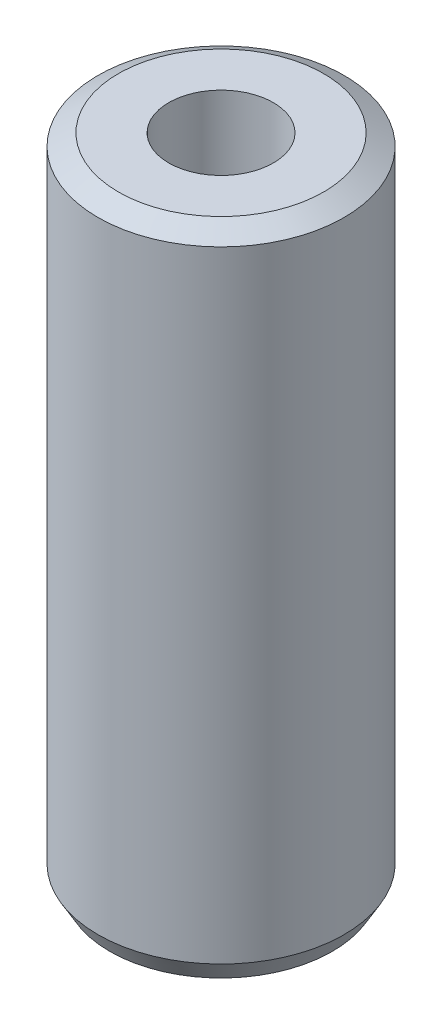
ISO-10303-21;
HEADER;
FILE_DESCRIPTION(('STEP AP214'),'2;1');
FILE_NAME('part.step','',(''),(''),'','','');
FILE_SCHEMA(('AUTOMOTIVE_DESIGN { 1 0 10303 214 1 1 1 1 }'));
ENDSEC;
DATA;
#1=APPLICATION_CONTEXT('core data for automotive mechanical design processes');
#2=APPLICATION_PROTOCOL_DEFINITION('international standard','automotive_design',2000,#1);
#3=PRODUCT_CONTEXT('',#1,'mechanical');
#4=PRODUCT('Part','Part','',(#3));
#5=PRODUCT_RELATED_PRODUCT_CATEGORY('part','',(#4));
#6=PRODUCT_DEFINITION_FORMATION('','',#4);
#7=PRODUCT_DEFINITION_CONTEXT('part definition',#1,'design');
#8=PRODUCT_DEFINITION('design','',#6,#7);
#9=PRODUCT_DEFINITION_SHAPE('','',#8);
#10=(LENGTH_UNIT() NAMED_UNIT(*) SI_UNIT(.MILLI.,.METRE.));
#11=(NAMED_UNIT(*) PLANE_ANGLE_UNIT() SI_UNIT($,.RADIAN.));
#12=(NAMED_UNIT(*) SI_UNIT($,.STERADIAN.) SOLID_ANGLE_UNIT());
#13=UNCERTAINTY_MEASURE_WITH_UNIT(LENGTH_MEASURE(1.E-05),#10,'distance_accuracy_value','');
#14=(GEOMETRIC_REPRESENTATION_CONTEXT(3) GLOBAL_UNCERTAINTY_ASSIGNED_CONTEXT((#13)) GLOBAL_UNIT_ASSIGNED_CONTEXT((#10,
#11,#12)) REPRESENTATION_CONTEXT('',''));
#15=CARTESIAN_POINT('',(0.,0.,0.));
#16=DIRECTION('',(0.,0.,1.));
#17=DIRECTION('',(1.,0.,0.));
#18=AXIS2_PLACEMENT_3D('',#15,#16,#17);
#19=CARTESIAN_POINT('',(0.,172.520171997669,0.));
#20=DIRECTION('',(0.,-1.,0.));
#21=DIRECTION('',(0.,0.,-1.));
#22=AXIS2_PLACEMENT_3D('',#19,#20,#21);
#23=CYLINDRICAL_SURFACE('',#22,32.5);
#24=CARTESIAN_POINT('',(0.,169.400193506494,0.));
#25=DIRECTION('',(0.,1.,0.));
#26=DIRECTION('',(0.,0.,1.));
#27=AXIS2_PLACEMENT_3D('',#24,#25,#26);
#28=CIRCLE('',#27,32.5);
#29=CARTESIAN_POINT('',(0.,169.400193506494,32.5));
#30=VERTEX_POINT('',#29);
#31=EDGE_CURVE('E50',#30,#30,#28,.F.);
#32=ORIENTED_EDGE('',*,*,#31,.T.);
#33=EDGE_LOOP('',(#32));
#34=FACE_BOUND('',#33,.T.);
#35=CARTESIAN_POINT('',(0.,5.40396126523684,0.));
#36=DIRECTION('',(0.,1.,0.));
#37=DIRECTION('',(0.,0.,1.));
#38=AXIS2_PLACEMENT_3D('',#35,#36,#37);
#39=CIRCLE('',#38,32.5);
#40=CARTESIAN_POINT('',(0.,5.40396126523684,32.5));
#41=VERTEX_POINT('',#40);
#42=EDGE_CURVE('E51',#41,#41,#39,.T.);
#43=ORIENTED_EDGE('',*,*,#42,.T.);
#44=EDGE_LOOP('',(#43));
#45=FACE_BOUND('',#44,.T.);
#46=ADVANCED_FACE('F39',(#34,#45),#23,.T.);
#47=CARTESIAN_POINT('',(0.,172.520171997669,0.));
#48=DIRECTION('',(0.,1.,0.));
#49=DIRECTION('',(0.,0.,1.));
#50=AXIS2_PLACEMENT_3D('',#47,#48,#49);
#51=PLANE('',#50);
#52=CARTESIAN_POINT('',(0.,172.520171997669,0.));
#53=DIRECTION('',(0.,1.,0.));
#54=DIRECTION('',(0.,0.,1.));
#55=AXIS2_PLACEMENT_3D('',#52,#53,#54);
#56=CIRCLE('',#55,27.096038734763);
#57=CARTESIAN_POINT('',(0.,172.520171997669,27.096038734763));
#58=VERTEX_POINT('',#57);
#59=EDGE_CURVE('E54',#58,#58,#56,.T.);
#60=ORIENTED_EDGE('',*,*,#59,.T.);
#61=EDGE_LOOP('',(#60));
#62=FACE_BOUND('',#61,.T.);
#63=CARTESIAN_POINT('',(0.,172.520171997669,0.));
#64=DIRECTION('',(0.,1.,0.));
#65=DIRECTION('',(0.,0.,1.));
#66=AXIS2_PLACEMENT_3D('',#63,#64,#65);
#67=CIRCLE('',#66,13.813941739618);
#68=CARTESIAN_POINT('',(0.,172.520171997669,13.813941739618));
#69=VERTEX_POINT('',#68);
#70=EDGE_CURVE('E58',#69,#69,#67,.T.);
#71=ORIENTED_EDGE('',*,*,#70,.F.);
#72=EDGE_LOOP('',(#71));
#73=FACE_BOUND('',#72,.T.);
#74=ADVANCED_FACE('F69',(#62,#73),#51,.T.);
#75=CARTESIAN_POINT('',(0.,0.,0.));
#76=DIRECTION('',(0.,1.,0.));
#77=DIRECTION('',(0.,0.,1.));
#78=AXIS2_PLACEMENT_3D('',#75,#76,#77);
#79=PLANE('',#78);
#80=CARTESIAN_POINT('',(0.,0.,0.));
#81=DIRECTION('',(0.,1.,0.));
#82=DIRECTION('',(0.,0.,1.));
#83=AXIS2_PLACEMENT_3D('',#80,#81,#82);
#84=CIRCLE('',#83,29.3800215088252);
#85=CARTESIAN_POINT('',(0.,0.,29.3800215088252));
#86=VERTEX_POINT('',#85);
#87=EDGE_CURVE('E10',#86,#86,#84,.F.);
#88=ORIENTED_EDGE('',*,*,#87,.T.);
#89=EDGE_LOOP('',(#88));
#90=FACE_BOUND('',#89,.T.);
#91=CARTESIAN_POINT('',(0.,0.,0.));
#92=DIRECTION('',(0.,1.,0.));
#93=DIRECTION('',(0.,0.,1.));
#94=AXIS2_PLACEMENT_3D('',#91,#92,#93);
#95=CIRCLE('',#94,13.813941739618);
#96=CARTESIAN_POINT('',(0.,0.,13.813941739618));
#97=VERTEX_POINT('',#96);
#98=EDGE_CURVE('E63',#97,#97,#95,.T.);
#99=ORIENTED_EDGE('',*,*,#98,.T.);
#100=EDGE_LOOP('',(#99));
#101=FACE_BOUND('',#100,.T.);
#102=ADVANCED_FACE('F75',(#90,#101),#79,.F.);
#103=CARTESIAN_POINT('',(0.,172.520171997669,0.));
#104=DIRECTION('',(0.,-1.,0.));
#105=DIRECTION('',(0.,0.,-1.));
#106=AXIS2_PLACEMENT_3D('',#103,#104,#105);
#107=CYLINDRICAL_SURFACE('',#106,13.813941739618);
#108=ORIENTED_EDGE('',*,*,#70,.T.);
#109=EDGE_LOOP('',(#108));
#110=FACE_BOUND('',#109,.T.);
#111=ORIENTED_EDGE('',*,*,#98,.F.);
#112=EDGE_LOOP('',(#111));
#113=FACE_BOUND('',#112,.T.);
#114=ADVANCED_FACE('F70',(#110,#113),#107,.F.);
#115=CARTESIAN_POINT('',(0.,172.520171997669,0.));
#116=DIRECTION('',(0.,-1.,0.));
#117=DIRECTION('',(0.,0.,-1.));
#118=AXIS2_PLACEMENT_3D('',#115,#116,#117);
#119=CONICAL_SURFACE('',#118,27.096038734763,1.0471975511966);
#120=ORIENTED_EDGE('',*,*,#31,.F.);
#121=EDGE_LOOP('',(#120));
#122=FACE_BOUND('',#121,.T.);
#123=ORIENTED_EDGE('',*,*,#59,.F.);
#124=EDGE_LOOP('',(#123));
#125=FACE_BOUND('',#124,.T.);
#126=ADVANCED_FACE('F81',(#122,#125),#119,.T.);
#127=CARTESIAN_POINT('',(0.,5.40396126523684,0.));
#128=DIRECTION('',(0.,1.,0.));
#129=DIRECTION('',(0.,0.,1.));
#130=AXIS2_PLACEMENT_3D('',#127,#128,#129);
#131=CONICAL_SURFACE('',#130,32.5,0.523598775598303);
#132=ORIENTED_EDGE('',*,*,#87,.F.);
#133=EDGE_LOOP('',(#132));
#134=FACE_BOUND('',#133,.T.);
#135=ORIENTED_EDGE('',*,*,#42,.F.);
#136=EDGE_LOOP('',(#135));
#137=FACE_BOUND('',#136,.T.);
#138=ADVANCED_FACE('F45',(#134,#137),#131,.T.);
#139=CLOSED_SHELL('',(#46,#74,#102,#114,#126,#138));
#140=MANIFOLD_SOLID_BREP('B2',#139);
#141=ADVANCED_BREP_SHAPE_REPRESENTATION('',(#18,#140),#14);
#142=SHAPE_DEFINITION_REPRESENTATION(#9,#141);
ENDSEC;
END-ISO-10303-21;
